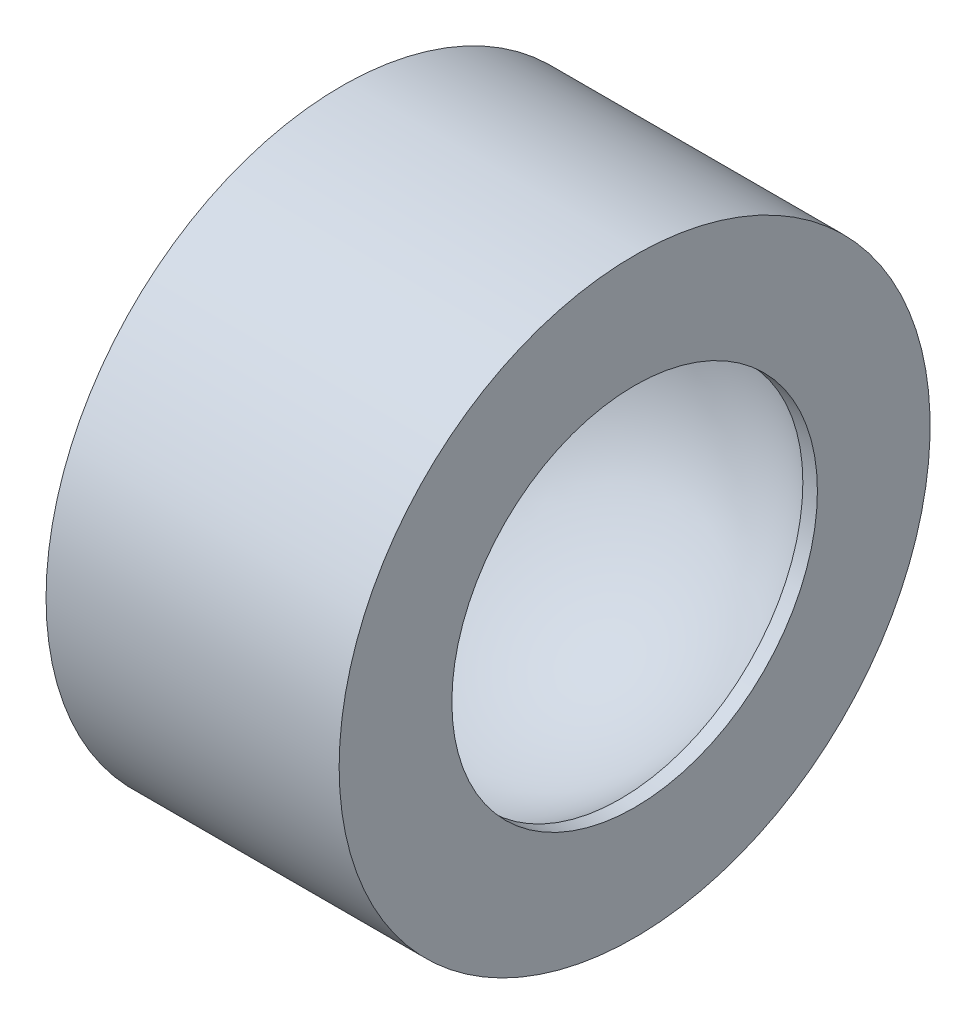
ISO-10303-21;
HEADER;
FILE_DESCRIPTION(('STEP AP214'),'2;1');
FILE_NAME('part.step','',(''),(''),'','','');
FILE_SCHEMA(('AUTOMOTIVE_DESIGN { 1 0 10303 214 1 1 1 1 }'));
ENDSEC;
DATA;
#1=APPLICATION_CONTEXT('core data for automotive mechanical design processes');
#2=APPLICATION_PROTOCOL_DEFINITION('international standard','automotive_design',2000,#1);
#3=PRODUCT_CONTEXT('',#1,'mechanical');
#4=PRODUCT('Part','Part','',(#3));
#5=PRODUCT_RELATED_PRODUCT_CATEGORY('part','',(#4));
#6=PRODUCT_DEFINITION_FORMATION('','',#4);
#7=PRODUCT_DEFINITION_CONTEXT('part definition',#1,'design');
#8=PRODUCT_DEFINITION('design','',#6,#7);
#9=PRODUCT_DEFINITION_SHAPE('','',#8);
#10=(LENGTH_UNIT() NAMED_UNIT(*) SI_UNIT(.MILLI.,.METRE.));
#11=(NAMED_UNIT(*) PLANE_ANGLE_UNIT() SI_UNIT($,.RADIAN.));
#12=(NAMED_UNIT(*) SI_UNIT($,.STERADIAN.) SOLID_ANGLE_UNIT());
#13=UNCERTAINTY_MEASURE_WITH_UNIT(LENGTH_MEASURE(1.E-05),#10,'distance_accuracy_value','');
#14=(GEOMETRIC_REPRESENTATION_CONTEXT(3) GLOBAL_UNCERTAINTY_ASSIGNED_CONTEXT((#13)) GLOBAL_UNIT_ASSIGNED_CONTEXT((#10,
#11,#12)) REPRESENTATION_CONTEXT('',''));
#15=CARTESIAN_POINT('',(0.,0.,0.));
#16=DIRECTION('',(0.,0.,1.));
#17=DIRECTION('',(1.,0.,0.));
#18=AXIS2_PLACEMENT_3D('',#15,#16,#17);
#19=CARTESIAN_POINT('',(-17.0799568376747,-8.10708753038727,0.));
#20=DIRECTION('',(-1.,0.,0.));
#21=DIRECTION('',(0.,0.,1.));
#22=AXIS2_PLACEMENT_3D('',#19,#20,#21);
#23=CYLINDRICAL_SURFACE('',#22,8.10708753038727);
#24=CARTESIAN_POINT('',(-5.85449671403437,-8.10708753038727,0.));
#25=DIRECTION('',(-1.,0.,0.));
#26=DIRECTION('',(0.,0.,1.));
#27=AXIS2_PLACEMENT_3D('',#24,#25,#26);
#28=CIRCLE('',#27,8.10708753038727);
#29=CARTESIAN_POINT('',(-5.85449671403437,-8.10708753038727,8.10708753038727));
#30=VERTEX_POINT('',#29);
#31=EDGE_CURVE('E64',#30,#30,#28,.T.);
#32=ORIENTED_EDGE('',*,*,#31,.F.);
#33=EDGE_LOOP('',(#32));
#34=FACE_BOUND('',#33,.T.);
#35=CARTESIAN_POINT('',(-6.5,-8.10708753038727,0.));
#36=DIRECTION('',(-1.,0.,0.));
#37=DIRECTION('',(0.,0.,1.));
#38=AXIS2_PLACEMENT_3D('',#35,#36,#37);
#39=CIRCLE('',#38,8.10708753038727);
#40=CARTESIAN_POINT('',(-6.5,-8.10708753038727,8.10708753038727));
#41=VERTEX_POINT('',#40);
#42=EDGE_CURVE('E10',#41,#41,#39,.T.);
#43=ORIENTED_EDGE('',*,*,#42,.T.);
#44=EDGE_LOOP('',(#43));
#45=FACE_BOUND('',#44,.T.);
#46=ADVANCED_FACE('F37',(#34,#45),#23,.F.);
#47=CARTESIAN_POINT('',(-6.5,5.,0.));
#48=DIRECTION('',(1.,0.,0.));
#49=DIRECTION('',(0.,0.,-1.));
#50=AXIS2_PLACEMENT_3D('',#47,#48,#49);
#51=PLANE('',#50);
#52=ORIENTED_EDGE('',*,*,#42,.F.);
#53=EDGE_LOOP('',(#52));
#54=FACE_BOUND('',#53,.T.);
#55=CARTESIAN_POINT('',(-6.5,-8.10708753038727,0.));
#56=DIRECTION('',(-1.,0.,0.));
#57=DIRECTION('',(0.,0.,1.));
#58=AXIS2_PLACEMENT_3D('',#55,#56,#57);
#59=CIRCLE('',#58,13.1070875303873);
#60=CARTESIAN_POINT('',(-6.5,-8.10708753038727,13.1070875303873));
#61=VERTEX_POINT('',#60);
#62=EDGE_CURVE('E44',#61,#61,#59,.T.);
#63=ORIENTED_EDGE('',*,*,#62,.T.);
#64=EDGE_LOOP('',(#63));
#65=FACE_BOUND('',#64,.T.);
#66=ADVANCED_FACE('F72',(#54,#65),#51,.F.);
#67=CARTESIAN_POINT('',(-17.0799568376747,-8.10708753038727,0.));
#68=DIRECTION('',(-1.,0.,0.));
#69=DIRECTION('',(0.,0.,1.));
#70=AXIS2_PLACEMENT_3D('',#67,#68,#69);
#71=CYLINDRICAL_SURFACE('',#70,13.1070875303873);
#72=ORIENTED_EDGE('',*,*,#62,.F.);
#73=EDGE_LOOP('',(#72));
#74=FACE_BOUND('',#73,.T.);
#75=CARTESIAN_POINT('',(6.5,-8.10708753038727,0.));
#76=DIRECTION('',(-1.,0.,0.));
#77=DIRECTION('',(0.,0.,1.));
#78=AXIS2_PLACEMENT_3D('',#75,#76,#77);
#79=CIRCLE('',#78,13.1070875303873);
#80=CARTESIAN_POINT('',(6.5,-8.10708753038727,13.1070875303873));
#81=VERTEX_POINT('',#80);
#82=EDGE_CURVE('E49',#81,#81,#79,.T.);
#83=ORIENTED_EDGE('',*,*,#82,.T.);
#84=EDGE_LOOP('',(#83));
#85=FACE_BOUND('',#84,.T.);
#86=ADVANCED_FACE('F76',(#74,#85),#71,.T.);
#87=CARTESIAN_POINT('',(6.5,5.,0.));
#88=DIRECTION('',(-1.,0.,0.));
#89=DIRECTION('',(0.,0.,1.));
#90=AXIS2_PLACEMENT_3D('',#87,#88,#89);
#91=PLANE('',#90);
#92=ORIENTED_EDGE('',*,*,#82,.F.);
#93=EDGE_LOOP('',(#92));
#94=FACE_BOUND('',#93,.T.);
#95=CARTESIAN_POINT('',(6.5,-8.10708753038727,0.));
#96=DIRECTION('',(-1.,0.,0.));
#97=DIRECTION('',(0.,0.,1.));
#98=AXIS2_PLACEMENT_3D('',#95,#96,#97);
#99=CIRCLE('',#98,8.10708753038727);
#100=CARTESIAN_POINT('',(6.5,-8.10708753038727,8.10708753038727));
#101=VERTEX_POINT('',#100);
#102=EDGE_CURVE('E54',#101,#101,#99,.T.);
#103=ORIENTED_EDGE('',*,*,#102,.T.);
#104=EDGE_LOOP('',(#103));
#105=FACE_BOUND('',#104,.T.);
#106=ADVANCED_FACE('F81',(#94,#105),#91,.F.);
#107=CARTESIAN_POINT('',(-17.0799568376747,-8.10708753038727,0.));
#108=DIRECTION('',(-1.,0.,0.));
#109=DIRECTION('',(0.,0.,1.));
#110=AXIS2_PLACEMENT_3D('',#107,#108,#109);
#111=CYLINDRICAL_SURFACE('',#110,8.10708753038727);
#112=ORIENTED_EDGE('',*,*,#102,.F.);
#113=EDGE_LOOP('',(#112));
#114=FACE_BOUND('',#113,.T.);
#115=CARTESIAN_POINT('',(5.85449671403437,-8.10708753038727,0.));
#116=DIRECTION('',(-1.,0.,0.));
#117=DIRECTION('',(0.,0.,1.));
#118=AXIS2_PLACEMENT_3D('',#115,#116,#117);
#119=CIRCLE('',#118,8.10708753038727);
#120=CARTESIAN_POINT('',(5.85449671403437,-8.10708753038727,8.10708753038727));
#121=VERTEX_POINT('',#120);
#122=EDGE_CURVE('E60',#121,#121,#119,.T.);
#123=ORIENTED_EDGE('',*,*,#122,.T.);
#124=EDGE_LOOP('',(#123));
#125=FACE_BOUND('',#124,.T.);
#126=ADVANCED_FACE('F87',(#114,#125),#111,.F.);
#127=CARTESIAN_POINT('',(0.,-8.10708753038727,0.));
#128=DIRECTION('',(-1.,0.,0.));
#129=DIRECTION('',(0.,1.,0.));
#130=AXIS2_PLACEMENT_3D('',#127,#128,#129);
#131=SPHERICAL_SURFACE('',#130,10.);
#132=ORIENTED_EDGE('',*,*,#122,.F.);
#133=EDGE_LOOP('',(#132));
#134=FACE_BOUND('',#133,.T.);
#135=ORIENTED_EDGE('',*,*,#31,.T.);
#136=EDGE_LOOP('',(#135));
#137=FACE_BOUND('',#136,.T.);
#138=ADVANCED_FACE('F69',(#134,#137),#131,.F.);
#139=CLOSED_SHELL('',(#46,#66,#86,#106,#126,#138));
#140=MANIFOLD_SOLID_BREP('B2',#139);
#141=ADVANCED_BREP_SHAPE_REPRESENTATION('',(#18,#140),#14);
#142=SHAPE_DEFINITION_REPRESENTATION(#9,#141);
ENDSEC;
END-ISO-10303-21;
